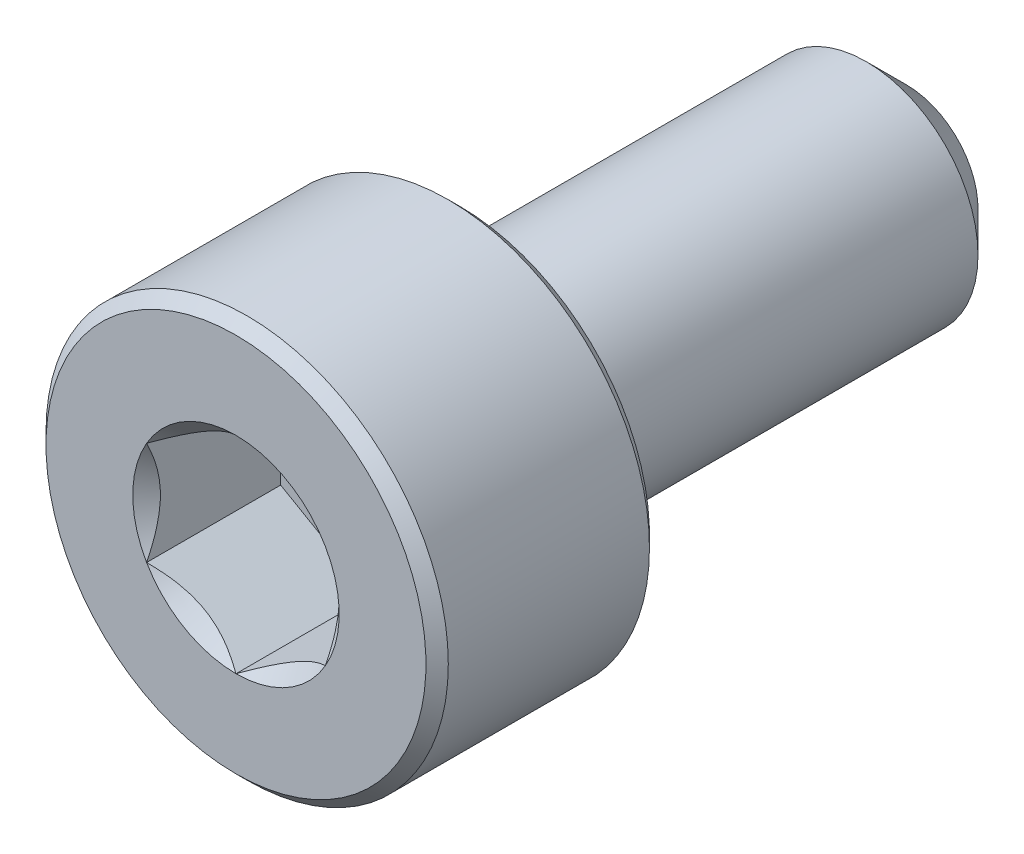
ISO-10303-21;
HEADER;
FILE_DESCRIPTION(('STEP AP214'),'2;1');
FILE_NAME('part.step','',(''),(''),'','','');
FILE_SCHEMA(('AUTOMOTIVE_DESIGN { 1 0 10303 214 1 1 1 1 }'));
ENDSEC;
DATA;
#1=APPLICATION_CONTEXT('core data for automotive mechanical design processes');
#2=APPLICATION_PROTOCOL_DEFINITION('international standard','automotive_design',2000,#1);
#3=PRODUCT_CONTEXT('',#1,'mechanical');
#4=PRODUCT('Part','Part','',(#3));
#5=PRODUCT_RELATED_PRODUCT_CATEGORY('part','',(#4));
#6=PRODUCT_DEFINITION_FORMATION('','',#4);
#7=PRODUCT_DEFINITION_CONTEXT('part definition',#1,'design');
#8=PRODUCT_DEFINITION('design','',#6,#7);
#9=PRODUCT_DEFINITION_SHAPE('','',#8);
#10=(LENGTH_UNIT() NAMED_UNIT(*) SI_UNIT(.MILLI.,.METRE.));
#11=(NAMED_UNIT(*) PLANE_ANGLE_UNIT() SI_UNIT($,.RADIAN.));
#12=(NAMED_UNIT(*) SI_UNIT($,.STERADIAN.) SOLID_ANGLE_UNIT());
#13=UNCERTAINTY_MEASURE_WITH_UNIT(LENGTH_MEASURE(1.E-05),#10,'distance_accuracy_value','');
#14=(GEOMETRIC_REPRESENTATION_CONTEXT(3) GLOBAL_UNCERTAINTY_ASSIGNED_CONTEXT((#13)) GLOBAL_UNIT_ASSIGNED_CONTEXT((#10,
#11,#12)) REPRESENTATION_CONTEXT('',''));
#15=CARTESIAN_POINT('',(0.,0.,0.));
#16=DIRECTION('',(0.,0.,1.));
#17=DIRECTION('',(1.,0.,0.));
#18=AXIS2_PLACEMENT_3D('',#15,#16,#17);
#19=CARTESIAN_POINT('',(0.,0.,3.75));
#20=DIRECTION('',(0.,0.,1.));
#21=DIRECTION('',(0.,-1.,0.));
#22=AXIS2_PLACEMENT_3D('',#19,#20,#21);
#23=PLANE('',#22);
#24=CARTESIAN_POINT('',(0.,0.,3.75));
#25=DIRECTION('',(0.,0.,1.));
#26=DIRECTION('',(1.,0.,0.));
#27=AXIS2_PLACEMENT_3D('',#24,#25,#26);
#28=CIRCLE('',#27,1.15470053837925);
#29=CARTESIAN_POINT('',(0.,-1.15470053837925,3.75));
#30=VERTEX_POINT('',#29);
#31=CARTESIAN_POINT('',(0.999999999999999,-0.577350269189624,3.75));
#32=VERTEX_POINT('',#31);
#33=EDGE_CURVE('E105',#30,#32,#28,.T.);
#34=ORIENTED_EDGE('',*,*,#33,.F.);
#35=CARTESIAN_POINT('',(-0.999999999999999,-0.577350269189626,3.75));
#36=VERTEX_POINT('',#35);
#37=EDGE_CURVE('E299',#36,#30,#28,.T.);
#38=ORIENTED_EDGE('',*,*,#37,.F.);
#39=CARTESIAN_POINT('',(-0.999999999999999,0.577350269189624,3.75));
#40=VERTEX_POINT('',#39);
#41=EDGE_CURVE('E146',#40,#36,#28,.T.);
#42=ORIENTED_EDGE('',*,*,#41,.F.);
#43=CARTESIAN_POINT('',(0.,1.15470053837925,3.75));
#44=VERTEX_POINT('',#43);
#45=EDGE_CURVE('E139',#44,#40,#28,.T.);
#46=ORIENTED_EDGE('',*,*,#45,.F.);
#47=CARTESIAN_POINT('',(0.999999999999998,0.577350269189626,3.75));
#48=VERTEX_POINT('',#47);
#49=EDGE_CURVE('E107',#48,#44,#28,.T.);
#50=ORIENTED_EDGE('',*,*,#49,.F.);
#51=EDGE_CURVE('E98',#32,#48,#28,.T.);
#52=ORIENTED_EDGE('',*,*,#51,.F.);
#53=EDGE_LOOP('',(#34,#38,#42,#46,#50,#52));
#54=FACE_BOUND('',#53,.T.);
#55=CARTESIAN_POINT('',(0.,0.,3.75));
#56=DIRECTION('',(0.,0.,-1.));
#57=DIRECTION('',(0.,1.,0.));
#58=AXIS2_PLACEMENT_3D('',#55,#56,#57);
#59=CIRCLE('',#58,2.125);
#60=CARTESIAN_POINT('',(0.,2.125,3.75));
#61=VERTEX_POINT('',#60);
#62=EDGE_CURVE('E54',#61,#61,#59,.T.);
#63=ORIENTED_EDGE('',*,*,#62,.F.);
#64=EDGE_LOOP('',(#63));
#65=FACE_BOUND('',#64,.T.);
#66=ADVANCED_FACE('F40',(#54,#65),#23,.T.);
#67=CARTESIAN_POINT('',(0.,0.,3.625));
#68=DIRECTION('',(0.,0.,-1.));
#69=DIRECTION('',(0.,1.,0.));
#70=AXIS2_PLACEMENT_3D('',#67,#68,#69);
#71=CONICAL_SURFACE('',#70,2.25,0.785398163397443);
#72=ORIENTED_EDGE('',*,*,#62,.T.);
#73=EDGE_LOOP('',(#72));
#74=FACE_BOUND('',#73,.T.);
#75=CARTESIAN_POINT('',(0.,0.,3.625));
#76=DIRECTION('',(0.,0.,-1.));
#77=DIRECTION('',(0.,1.,0.));
#78=AXIS2_PLACEMENT_3D('',#75,#76,#77);
#79=CIRCLE('',#78,2.25);
#80=CARTESIAN_POINT('',(0.,2.25,3.625));
#81=VERTEX_POINT('',#80);
#82=EDGE_CURVE('E232',#81,#81,#79,.T.);
#83=ORIENTED_EDGE('',*,*,#82,.F.);
#84=EDGE_LOOP('',(#83));
#85=FACE_BOUND('',#84,.T.);
#86=ADVANCED_FACE('F220',(#74,#85),#71,.T.);
#87=CARTESIAN_POINT('',(0.,0.,-3.75));
#88=DIRECTION('',(0.,0.,-1.));
#89=DIRECTION('',(0.,1.,0.));
#90=AXIS2_PLACEMENT_3D('',#87,#88,#89);
#91=CYLINDRICAL_SURFACE('',#90,2.25);
#92=ORIENTED_EDGE('',*,*,#82,.T.);
#93=EDGE_LOOP('',(#92));
#94=FACE_BOUND('',#93,.T.);
#95=CARTESIAN_POINT('',(0.,0.,1.375));
#96=DIRECTION('',(0.,0.,-1.));
#97=DIRECTION('',(0.,1.,0.));
#98=AXIS2_PLACEMENT_3D('',#95,#96,#97);
#99=CIRCLE('',#98,2.25);
#100=CARTESIAN_POINT('',(0.,2.25,1.375));
#101=VERTEX_POINT('',#100);
#102=EDGE_CURVE('E234',#101,#101,#99,.T.);
#103=ORIENTED_EDGE('',*,*,#102,.F.);
#104=EDGE_LOOP('',(#103));
#105=FACE_BOUND('',#104,.T.);
#106=ADVANCED_FACE('F217',(#94,#105),#91,.T.);
#107=CARTESIAN_POINT('',(0.,0.,1.25));
#108=DIRECTION('',(0.,0.,1.));
#109=DIRECTION('',(0.,-1.,0.));
#110=AXIS2_PLACEMENT_3D('',#107,#108,#109);
#111=CONICAL_SURFACE('',#110,2.125,0.785398163397447);
#112=ORIENTED_EDGE('',*,*,#102,.T.);
#113=EDGE_LOOP('',(#112));
#114=FACE_BOUND('',#113,.T.);
#115=CARTESIAN_POINT('',(0.,0.,1.25));
#116=DIRECTION('',(0.,0.,-1.));
#117=DIRECTION('',(0.,1.,0.));
#118=AXIS2_PLACEMENT_3D('',#115,#116,#117);
#119=CIRCLE('',#118,2.125);
#120=CARTESIAN_POINT('',(0.,2.125,1.25));
#121=VERTEX_POINT('',#120);
#122=EDGE_CURVE('E239',#121,#121,#119,.T.);
#123=ORIENTED_EDGE('',*,*,#122,.F.);
#124=EDGE_LOOP('',(#123));
#125=FACE_BOUND('',#124,.T.);
#126=ADVANCED_FACE('F213',(#114,#125),#111,.T.);
#127=CARTESIAN_POINT('',(0.,2.125,1.25));
#128=DIRECTION('',(0.,0.,-1.));
#129=DIRECTION('',(0.,1.,0.));
#130=AXIS2_PLACEMENT_3D('',#127,#128,#129);
#131=PLANE('',#130);
#132=ORIENTED_EDGE('',*,*,#122,.T.);
#133=EDGE_LOOP('',(#132));
#134=FACE_BOUND('',#133,.T.);
#135=CARTESIAN_POINT('',(0.,0.,1.25));
#136=DIRECTION('',(0.,0.,-1.));
#137=DIRECTION('',(0.,1.,0.));
#138=AXIS2_PLACEMENT_3D('',#135,#136,#137);
#139=CIRCLE('',#138,1.25);
#140=CARTESIAN_POINT('',(0.,1.25,1.25));
#141=VERTEX_POINT('',#140);
#142=EDGE_CURVE('E245',#141,#141,#139,.T.);
#143=ORIENTED_EDGE('',*,*,#142,.F.);
#144=EDGE_LOOP('',(#143));
#145=FACE_BOUND('',#144,.T.);
#146=ADVANCED_FACE('F209',(#134,#145),#131,.T.);
#147=CARTESIAN_POINT('',(0.,0.,-3.75));
#148=DIRECTION('',(0.,0.,-1.));
#149=DIRECTION('',(0.,1.,0.));
#150=AXIS2_PLACEMENT_3D('',#147,#148,#149);
#151=CYLINDRICAL_SURFACE('',#150,1.25);
#152=ORIENTED_EDGE('',*,*,#142,.T.);
#153=EDGE_LOOP('',(#152));
#154=FACE_BOUND('',#153,.T.);
#155=CARTESIAN_POINT('',(0.,0.,-3.29999999999999));
#156=DIRECTION('',(0.,0.,-1.));
#157=DIRECTION('',(0.,1.,0.));
#158=AXIS2_PLACEMENT_3D('',#155,#156,#157);
#159=CIRCLE('',#158,1.25);
#160=CARTESIAN_POINT('',(0.,1.25,-3.29999999999999));
#161=VERTEX_POINT('',#160);
#162=EDGE_CURVE('E249',#161,#161,#159,.T.);
#163=ORIENTED_EDGE('',*,*,#162,.F.);
#164=EDGE_LOOP('',(#163));
#165=FACE_BOUND('',#164,.T.);
#166=ADVANCED_FACE('F205',(#154,#165),#151,.T.);
#167=CARTESIAN_POINT('',(0.,0.,-3.75));
#168=DIRECTION('',(0.,0.,1.));
#169=DIRECTION('',(0.,-1.,0.));
#170=AXIS2_PLACEMENT_3D('',#167,#168,#169);
#171=CONICAL_SURFACE('',#170,0.8,0.785398163397441);
#172=ORIENTED_EDGE('',*,*,#162,.T.);
#173=EDGE_LOOP('',(#172));
#174=FACE_BOUND('',#173,.T.);
#175=CARTESIAN_POINT('',(0.,0.,-3.75));
#176=DIRECTION('',(0.,0.,-1.));
#177=DIRECTION('',(0.,1.,0.));
#178=AXIS2_PLACEMENT_3D('',#175,#176,#177);
#179=CIRCLE('',#178,0.8);
#180=CARTESIAN_POINT('',(0.,0.8,-3.75));
#181=VERTEX_POINT('',#180);
#182=EDGE_CURVE('E253',#181,#181,#179,.T.);
#183=ORIENTED_EDGE('',*,*,#182,.F.);
#184=EDGE_LOOP('',(#183));
#185=FACE_BOUND('',#184,.T.);
#186=ADVANCED_FACE('F201',(#174,#185),#171,.T.);
#187=CARTESIAN_POINT('',(0.,0.8,-3.75));
#188=DIRECTION('',(0.,0.,-1.));
#189=DIRECTION('',(0.,1.,0.));
#190=AXIS2_PLACEMENT_3D('',#187,#188,#189);
#191=PLANE('',#190);
#192=ORIENTED_EDGE('',*,*,#182,.T.);
#193=EDGE_LOOP('',(#192));
#194=FACE_BOUND('',#193,.T.);
#195=ADVANCED_FACE('F198',(#194),#191,.T.);
#196=CARTESIAN_POINT('',(0.,0.,3.75));
#197=DIRECTION('',(0.,0.,1.));
#198=DIRECTION('',(1.,0.,0.));
#199=AXIS2_PLACEMENT_3D('',#196,#197,#198);
#200=CONICAL_SURFACE('',#199,1.15470053837925,0.78539816339745);
#201=ORIENTED_EDGE('',*,*,#33,.T.);
#202=CARTESIAN_POINT('',(-0.000200000000000403,-1.15481600843309,3.75011548737261));
#203=CARTESIAN_POINT('',(0.0341825950071803,-1.13496520795025,3.73027793082573));
#204=CARTESIAN_POINT('',(0.0691401181398246,-1.11478247255942,3.71160502063889));
#205=CARTESIAN_POINT('',(0.140422802956089,-1.07362739529219,3.67741474272316));
#206=CARTESIAN_POINT('',(0.176754750528984,-1.0526511355808,3.66191640902346));
#207=CARTESIAN_POINT('',(0.250016613803311,-1.01035337909803,3.63536730714227));
#208=CARTESIAN_POINT('',(0.286927851445414,-0.989042666109239,3.62424977399693));
#209=CARTESIAN_POINT('',(0.361562729310859,-0.945952199282689,3.60711986577618));
#210=CARTESIAN_POINT('',(0.399284088108635,-0.924173762626594,3.60109469746667));
#211=CARTESIAN_POINT('',(0.464292198417933,-0.886641312640013,3.59566055496749));
#212=CARTESIAN_POINT('',(0.491494371528171,-0.870936130672274,3.59485693831673));
#213=CARTESIAN_POINT('',(0.545846040669111,-0.839556179862847,3.59620669941689));
#214=CARTESIAN_POINT('',(0.572995523754875,-0.823881418494922,3.5983607295472));
#215=CARTESIAN_POINT('',(0.654056277326959,-0.777080970599365,3.60911697212847));
#216=CARTESIAN_POINT('',(0.707564140978426,-0.746188191116429,3.62201455641536));
#217=CARTESIAN_POINT('',(0.801476065143431,-0.691968116419648,3.65314073060218));
#218=CARTESIAN_POINT('',(0.842320523671834,-0.668386557293369,3.66973779770184));
#219=CARTESIAN_POINT('',(0.922409637381943,-0.622147085933679,3.70712492468529));
#220=CARTESIAN_POINT('',(0.961659010870437,-0.599486449584573,3.7279013418174));
#221=CARTESIAN_POINT('',(1.0002,-0.577234799135786,3.75011548737261));
#222=B_SPLINE_CURVE_WITH_KNOTS('',3,(#202,#203,#204,#205,#206,#207,#208,#209,#210,#211,#212,
#213,#214,#215,#216,#217,#218,#219,#220,#221),.UNSPECIFIED.,.F.,.F.,(4,2,2,2,2,2,2,2,2,4),(0.,
0.133237676828559,0.26725222983449,0.3991370762693,0.530689603280768,0.624814864263846,
0.718960890149132,0.907306626112097,1.05710100361789,1.20641411519286),.UNSPECIFIED.);
#223=EDGE_CURVE('E12',#30,#32,#222,.T.);
#224=ORIENTED_EDGE('',*,*,#223,.F.);
#225=EDGE_LOOP('',(#201,#224));
#226=FACE_BOUND('',#225,.T.);
#227=ADVANCED_FACE('F164',(#226),#200,.F.);
#228=ORIENTED_EDGE('',*,*,#37,.T.);
#229=CARTESIAN_POINT('',(-1.0002,-0.577234799135788,3.75011548737261));
#230=CARTESIAN_POINT('',(-0.965817404992818,-0.597085599618621,3.73027793082573));
#231=CARTESIAN_POINT('',(-0.930859881860174,-0.617268335009456,3.71160502063889));
#232=CARTESIAN_POINT('',(-0.859577197043909,-0.658423412276686,3.67741474272316));
#233=CARTESIAN_POINT('',(-0.823245249471015,-0.679399671988079,3.66191640902346));
#234=CARTESIAN_POINT('',(-0.749983386196688,-0.721697428470846,3.63536730714227));
#235=CARTESIAN_POINT('',(-0.713072148554585,-0.743008141459636,3.62424977399693));
#236=CARTESIAN_POINT('',(-0.63843727068914,-0.786098608286185,3.60711986577618));
#237=CARTESIAN_POINT('',(-0.600715911891363,-0.80787704494228,3.60109469746667));
#238=CARTESIAN_POINT('',(-0.535707801582066,-0.845409494928862,3.59566055496749));
#239=CARTESIAN_POINT('',(-0.508505628471827,-0.861114676896601,3.59485693831673));
#240=CARTESIAN_POINT('',(-0.454153959330887,-0.892494627706028,3.59620669941689));
#241=CARTESIAN_POINT('',(-0.427004476245124,-0.908169389073953,3.5983607295472));
#242=CARTESIAN_POINT('',(-0.345943722673039,-0.95496983696951,3.60911697212847));
#243=CARTESIAN_POINT('',(-0.292435859021572,-0.985862616452446,3.62201455641536));
#244=CARTESIAN_POINT('',(-0.198523934856568,-1.04008269114923,3.65314073060218));
#245=CARTESIAN_POINT('',(-0.157679476328165,-1.0636642502755,3.66973779770184));
#246=CARTESIAN_POINT('',(-0.0775903626180565,-1.10990372163519,3.70712492468529));
#247=CARTESIAN_POINT('',(-0.0383409891295626,-1.1325643579843,3.7279013418174));
#248=CARTESIAN_POINT('',(0.000199999999999418,-1.15481600843309,3.75011548737261));
#249=B_SPLINE_CURVE_WITH_KNOTS('',3,(#229,#230,#231,#232,#233,#234,#235,#236,#237,#238,#239,
#240,#241,#242,#243,#244,#245,#246,#247,#248),.UNSPECIFIED.,.F.,.F.,(4,2,2,2,2,2,2,2,2,4),(0.,
0.133237676828559,0.26725222983449,0.3991370762693,0.530689603280768,0.624814864263845,
0.718960890149132,0.907306626112096,1.05710100361789,1.20641411519286),.UNSPECIFIED.);
#250=EDGE_CURVE('E141',#36,#30,#249,.T.);
#251=ORIENTED_EDGE('',*,*,#250,.F.);
#252=EDGE_LOOP('',(#228,#251));
#253=FACE_BOUND('',#252,.T.);
#254=ADVANCED_FACE('F297',(#253),#200,.F.);
#255=ORIENTED_EDGE('',*,*,#41,.T.);
#256=CARTESIAN_POINT('',(-0.999999999999999,-1.15147208646462,4.12038567751386));
#257=CARTESIAN_POINT('',(-0.999999999999999,-1.12343447988552,4.09921991987371));
#258=CARTESIAN_POINT('',(-0.999999999999999,-1.09524064850697,4.07826169217591));
#259=CARTESIAN_POINT('',(-0.999999999999999,-1.03847715644376,4.03684602223562));
#260=CARTESIAN_POINT('',(-0.999999999999999,-1.00990740382975,4.01638870612366));
#261=CARTESIAN_POINT('',(-0.999999999999999,-0.923120894333475,3.95560479495451));
#262=CARTESIAN_POINT('',(-0.999999999999999,-0.864253173759058,3.9161922289614));
#263=CARTESIAN_POINT('',(-0.999999999999999,-0.740809858258045,3.83882066420021));
#264=CARTESIAN_POINT('',(-0.999999999999999,-0.676100255137806,3.80107303911434));
#265=CARTESIAN_POINT('',(-0.999999999999999,-0.543448939049124,3.73202458755129));
#266=CARTESIAN_POINT('',(-0.999999999999999,-0.475519112027778,3.70070202784687));
#267=CARTESIAN_POINT('',(-0.999999999999999,-0.373555850333528,3.6623817788838));
#268=CARTESIAN_POINT('',(-0.999999999999999,-0.341031989670907,3.65138359164216));
#269=CARTESIAN_POINT('',(-0.999999999999999,-0.275199079052293,3.63199834214736));
#270=CARTESIAN_POINT('',(-0.999999999999999,-0.241889975173933,3.6236114597767));
#271=CARTESIAN_POINT('',(-0.999999999999999,-0.175247517042992,3.61002522071902));
#272=CARTESIAN_POINT('',(-0.999999999999999,-0.141925568218175,3.60477079076797));
#273=CARTESIAN_POINT('',(-0.999999999999999,-0.074914436232279,3.59754868657089));
#274=CARTESIAN_POINT('',(-0.999999999999999,-0.0412251978501618,3.59558151361051));
#275=CARTESIAN_POINT('',(-0.999999999999999,0.0249580992634208,3.59508319839316));
#276=CARTESIAN_POINT('',(-0.999999999999999,0.0574512826460391,3.59643026788864));
#277=CARTESIAN_POINT('',(-0.999999999999999,0.122148505701866,3.60221648449899));
#278=CARTESIAN_POINT('',(-0.999999999999999,0.154352610132926,3.60665492066154));
#279=CARTESIAN_POINT('',(-0.999999999999999,0.218799898867639,3.6184568301452));
#280=CARTESIAN_POINT('',(-0.999999999999999,0.251033743268953,3.62587054103851));
#281=CARTESIAN_POINT('',(-0.999999999999999,0.314797132354918,3.64322894249868));
#282=CARTESIAN_POINT('',(-0.999999999999999,0.346326735731004,3.65317342128883));
#283=CARTESIAN_POINT('',(-0.999999999999999,0.445594187730204,3.68822348255434));
#284=CARTESIAN_POINT('',(-0.999999999999999,0.511919139476035,3.71732085835673));
#285=CARTESIAN_POINT('',(-0.999999999999999,0.641453244657531,3.78201532968651));
#286=CARTESIAN_POINT('',(-0.999999999999999,0.704650133126343,3.81763577671524));
#287=CARTESIAN_POINT('',(-0.999999999999999,0.825428490174985,3.89112390134694));
#288=CARTESIAN_POINT('',(-0.999999999999999,0.883132947867684,3.92879194713546));
#289=CARTESIAN_POINT('',(-0.999999999999999,0.968148853704564,3.98702285294316));
#290=CARTESIAN_POINT('',(-0.999999999999999,0.996120570380284,4.00663847576286));
#291=CARTESIAN_POINT('',(-0.999999999999999,1.05168177729901,4.04638851706127));
#292=CARTESIAN_POINT('',(-0.999999999999999,1.079271369977,4.06652279219883));
#293=CARTESIAN_POINT('',(-0.999999999999999,1.10670185346329,4.08687211907297));
#294=B_SPLINE_CURVE_WITH_KNOTS('',3,(#256,#257,#258,#259,#260,#261,#262,#263,#264,#265,#266,
#267,#268,#269,#270,#271,#272,#273,#274,#275,#276,#277,#278,#279,#280,#281,#282,#283,#284,#285,
#286,#287,#288,#289,#290,#291,#292,#293),.UNSPECIFIED.,.F.,.F.,(4,2,2,2,2,2,2,2,2,2,2,2,2,2,2,2,
2,2,4),(0.,0.10538645908329,0.210799187330124,0.423233611565468,0.647793540908502,
0.871580877738608,0.974493074181419,1.07741235827201,1.17846428203204,1.27953161415762,
1.3769408673961,1.47432772585408,1.57343322804293,1.67253043972851,1.88917353996827,
2.10660791038813,2.31323734249843,2.41572589232044,2.51818641476503),.UNSPECIFIED.);
#295=EDGE_CURVE('E144',#40,#36,#294,.F.);
#296=ORIENTED_EDGE('',*,*,#295,.F.);
#297=EDGE_LOOP('',(#255,#296));
#298=FACE_BOUND('',#297,.T.);
#299=ADVANCED_FACE('F302',(#298),#200,.F.);
#300=ORIENTED_EDGE('',*,*,#45,.T.);
#301=CARTESIAN_POINT('',(0.000199999999999434,1.15481600843309,3.75011548737261));
#302=CARTESIAN_POINT('',(-0.0341825950071811,1.13496520795025,3.73027793082573));
#303=CARTESIAN_POINT('',(-0.0691401181398252,1.11478247255942,3.71160502063889));
#304=CARTESIAN_POINT('',(-0.14042280295609,1.07362739529219,3.67741474272316));
#305=CARTESIAN_POINT('',(-0.176754750528984,1.0526511355808,3.66191640902346));
#306=CARTESIAN_POINT('',(-0.250016613803311,1.01035337909803,3.63536730714227));
#307=CARTESIAN_POINT('',(-0.286927851445414,0.98904266610924,3.62424977399693));
#308=CARTESIAN_POINT('',(-0.361562729310859,0.94595219928269,3.60711986577618));
#309=CARTESIAN_POINT('',(-0.399284088108635,0.924173762626596,3.60109469746667));
#310=CARTESIAN_POINT('',(-0.464292198417933,0.886641312640014,3.5956605549675));
#311=CARTESIAN_POINT('',(-0.491494371528171,0.870936130672275,3.59485693831673));
#312=CARTESIAN_POINT('',(-0.545846040669111,0.839556179862848,3.59620669941689));
#313=CARTESIAN_POINT('',(-0.572995523754875,0.823881418494923,3.5983607295472));
#314=CARTESIAN_POINT('',(-0.654056277326959,0.777080970599366,3.60911697212847));
#315=CARTESIAN_POINT('',(-0.707564140978426,0.74618819111643,3.62201455641536));
#316=CARTESIAN_POINT('',(-0.801476065143431,0.691968116419649,3.65314073060218));
#317=CARTESIAN_POINT('',(-0.842320523671833,0.668386557293371,3.66973779770184));
#318=CARTESIAN_POINT('',(-0.922409637381943,0.622147085933681,3.70712492468529));
#319=CARTESIAN_POINT('',(-0.961659010870437,0.599486449584575,3.72790134181741));
#320=CARTESIAN_POINT('',(-1.0002,0.577234799135788,3.75011548737262));
#321=B_SPLINE_CURVE_WITH_KNOTS('',3,(#301,#302,#303,#304,#305,#306,#307,#308,#309,#310,#311,
#312,#313,#314,#315,#316,#317,#318,#319,#320),.UNSPECIFIED.,.F.,.F.,(4,2,2,2,2,2,2,2,2,4),(0.,
0.133237676828559,0.26725222983449,0.399137076269299,0.530689603280767,0.624814864263844,
0.718960890149131,0.907306626112095,1.05710100361789,1.20641411519286),.UNSPECIFIED.);
#322=EDGE_CURVE('E118',#44,#40,#321,.T.);
#323=ORIENTED_EDGE('',*,*,#322,.F.);
#324=EDGE_LOOP('',(#300,#323));
#325=FACE_BOUND('',#324,.T.);
#326=ADVANCED_FACE('F341',(#325),#200,.F.);
#327=ORIENTED_EDGE('',*,*,#49,.T.);
#328=CARTESIAN_POINT('',(1.0002,0.577234799135787,3.75011548737262));
#329=CARTESIAN_POINT('',(0.965817404992819,0.59708559961862,3.73027793082573));
#330=CARTESIAN_POINT('',(0.930859881860175,0.617268335009455,3.71160502063889));
#331=CARTESIAN_POINT('',(0.85957719704391,0.658423412276685,3.67741474272316));
#332=CARTESIAN_POINT('',(0.823245249471016,0.679399671988079,3.66191640902346));
#333=CARTESIAN_POINT('',(0.749983386196689,0.721697428470845,3.63536730714227));
#334=CARTESIAN_POINT('',(0.713072148554586,0.743008141459636,3.62424977399693));
#335=CARTESIAN_POINT('',(0.638437270689141,0.786098608286185,3.60711986577618));
#336=CARTESIAN_POINT('',(0.600715911891364,0.80787704494228,3.60109469746667));
#337=CARTESIAN_POINT('',(0.535707801582067,0.845409494928862,3.59566055496749));
#338=CARTESIAN_POINT('',(0.508505628471828,0.861114676896601,3.59485693831673));
#339=CARTESIAN_POINT('',(0.454153959330888,0.892494627706028,3.59620669941689));
#340=CARTESIAN_POINT('',(0.427004476245125,0.908169389073952,3.5983607295472));
#341=CARTESIAN_POINT('',(0.34594372267304,0.954969836969509,3.60911697212847));
#342=CARTESIAN_POINT('',(0.292435859021573,0.985862616452445,3.62201455641536));
#343=CARTESIAN_POINT('',(0.198523934856569,1.04008269114923,3.65314073060218));
#344=CARTESIAN_POINT('',(0.157679476328166,1.0636642502755,3.66973779770184));
#345=CARTESIAN_POINT('',(0.077590362618056,1.10990372163519,3.70712492468529));
#346=CARTESIAN_POINT('',(0.0383409891295618,1.1325643579843,3.7279013418174));
#347=CARTESIAN_POINT('',(-0.000200000000000499,1.15481600843309,3.75011548737262));
#348=B_SPLINE_CURVE_WITH_KNOTS('',3,(#328,#329,#330,#331,#332,#333,#334,#335,#336,#337,#338,
#339,#340,#341,#342,#343,#344,#345,#346,#347),.UNSPECIFIED.,.F.,.F.,(4,2,2,2,2,2,2,2,2,4),(0.,
0.133237676828559,0.26725222983449,0.3991370762693,0.530689603280768,0.624814864263846,
0.718960890149133,0.907306626112097,1.05710100361789,1.20641411519286),.UNSPECIFIED.);
#349=EDGE_CURVE('E110',#48,#44,#348,.T.);
#350=ORIENTED_EDGE('',*,*,#349,.F.);
#351=EDGE_LOOP('',(#327,#350));
#352=FACE_BOUND('',#351,.T.);
#353=ADVANCED_FACE('F111',(#352),#200,.F.);
#354=ORIENTED_EDGE('',*,*,#51,.T.);
#355=CARTESIAN_POINT('',(1.,-1.15147208646461,4.12038567751386));
#356=CARTESIAN_POINT('',(1.,-1.12343447988551,4.09921991987371));
#357=CARTESIAN_POINT('',(1.,-1.09524064850697,4.07826169217591));
#358=CARTESIAN_POINT('',(1.,-1.03847715644376,4.03684602223562));
#359=CARTESIAN_POINT('',(1.,-1.00990740382975,4.01638870612366));
#360=CARTESIAN_POINT('',(1.,-0.923120894333472,3.95560479495451));
#361=CARTESIAN_POINT('',(1.,-0.864253173759055,3.9161922289614));
#362=CARTESIAN_POINT('',(1.,-0.740809858258041,3.8388206642002));
#363=CARTESIAN_POINT('',(1.,-0.676100255137803,3.80107303911434));
#364=CARTESIAN_POINT('',(1.,-0.543448939049121,3.73202458755129));
#365=CARTESIAN_POINT('',(1.,-0.475519112027776,3.70070202784687));
#366=CARTESIAN_POINT('',(1.,-0.373555850333526,3.6623817788838));
#367=CARTESIAN_POINT('',(1.,-0.341031989670905,3.65138359164216));
#368=CARTESIAN_POINT('',(1.,-0.275199079052291,3.63199834214736));
#369=CARTESIAN_POINT('',(1.,-0.241889975173931,3.6236114597767));
#370=CARTESIAN_POINT('',(1.,-0.175247517042991,3.61002522071902));
#371=CARTESIAN_POINT('',(1.,-0.141925568218173,3.60477079076797));
#372=CARTESIAN_POINT('',(1.,-0.0749144362322774,3.59754868657089));
#373=CARTESIAN_POINT('',(1.,-0.0412251978501602,3.59558151361051));
#374=CARTESIAN_POINT('',(1.,0.0249580992634224,3.59508319839316));
#375=CARTESIAN_POINT('',(1.,0.0574512826460407,3.59643026788864));
#376=CARTESIAN_POINT('',(1.,0.122148505701868,3.60221648449899));
#377=CARTESIAN_POINT('',(1.,0.154352610132927,3.60665492066154));
#378=CARTESIAN_POINT('',(1.,0.218799898867641,3.61845683014521));
#379=CARTESIAN_POINT('',(1.,0.251033743268954,3.62587054103851));
#380=CARTESIAN_POINT('',(1.,0.314797132354919,3.64322894249868));
#381=CARTESIAN_POINT('',(1.,0.346326735731005,3.65317342128883));
#382=CARTESIAN_POINT('',(1.,0.445594187730205,3.68822348255434));
#383=CARTESIAN_POINT('',(1.,0.511919139476036,3.71732085835673));
#384=CARTESIAN_POINT('',(1.,0.641453244657532,3.78201532968651));
#385=CARTESIAN_POINT('',(1.,0.704650133126344,3.81763577671524));
#386=CARTESIAN_POINT('',(1.,0.825428490174986,3.89112390134694));
#387=CARTESIAN_POINT('',(1.,0.883132947867685,3.92879194713546));
#388=CARTESIAN_POINT('',(1.,0.968148853704565,3.98702285294316));
#389=CARTESIAN_POINT('',(1.,0.996120570380285,4.00663847576286));
#390=CARTESIAN_POINT('',(1.,1.05168177729901,4.04638851706127));
#391=CARTESIAN_POINT('',(1.,1.079271369977,4.06652279219883));
#392=CARTESIAN_POINT('',(1.,1.10670185346329,4.08687211907297));
#393=B_SPLINE_CURVE_WITH_KNOTS('',3,(#355,#356,#357,#358,#359,#360,#361,#362,#363,#364,#365,
#366,#367,#368,#369,#370,#371,#372,#373,#374,#375,#376,#377,#378,#379,#380,#381,#382,#383,#384,
#385,#386,#387,#388,#389,#390,#391,#392),.UNSPECIFIED.,.F.,.F.,(4,2,2,2,2,2,2,2,2,2,2,2,2,2,2,2,
2,2,4),(0.,0.105386459083291,0.210799187330124,0.423233611565468,0.647793540908501,
0.871580877738606,0.974493074181417,1.07741235827201,1.17846428203204,1.27953161415762,
1.3769408673961,1.47432772585407,1.57343322804293,1.67253043972851,1.88917353996827,
2.10660791038812,2.31323734249843,2.41572589232044,2.51818641476502),.UNSPECIFIED.);
#394=EDGE_CURVE('E60',#32,#48,#393,.T.);
#395=ORIENTED_EDGE('',*,*,#394,.F.);
#396=EDGE_LOOP('',(#354,#395));
#397=FACE_BOUND('',#396,.T.);
#398=ADVANCED_FACE('F100',(#397),#200,.F.);
#399=CARTESIAN_POINT('',(0.,2.125,2.25));
#400=DIRECTION('',(0.,0.,-1.));
#401=DIRECTION('',(0.,1.,0.));
#402=AXIS2_PLACEMENT_3D('',#399,#400,#401);
#403=PLANE('',#402);
#404=DIRECTION('',(0.866025403784438,0.5,0.));
#405=VECTOR('',#404,1.);
#406=CARTESIAN_POINT('',(0.,-1.15470053837925,2.25));
#407=LINE('',#406,#405);
#408=CARTESIAN_POINT('',(0.,-1.15470053837925,2.25));
#409=VERTEX_POINT('',#408);
#410=CARTESIAN_POINT('',(1.,-0.577350269189623,2.25));
#411=VERTEX_POINT('',#410);
#412=EDGE_CURVE('E258',#409,#411,#407,.T.);
#413=ORIENTED_EDGE('',*,*,#412,.T.);
#414=DIRECTION('',(0.,1.,0.));
#415=VECTOR('',#414,1.);
#416=CARTESIAN_POINT('',(1.,-0.577350269189623,2.25));
#417=LINE('',#416,#415);
#418=CARTESIAN_POINT('',(1.,0.577350269189625,2.25));
#419=VERTEX_POINT('',#418);
#420=EDGE_CURVE('E129',#411,#419,#417,.T.);
#421=ORIENTED_EDGE('',*,*,#420,.T.);
#422=DIRECTION('',(-0.866025403784439,0.5,0.));
#423=VECTOR('',#422,1.);
#424=CARTESIAN_POINT('',(1.,0.577350269189625,2.25));
#425=LINE('',#424,#423);
#426=CARTESIAN_POINT('',(0.,1.15470053837925,2.25));
#427=VERTEX_POINT('',#426);
#428=EDGE_CURVE('E133',#419,#427,#425,.T.);
#429=ORIENTED_EDGE('',*,*,#428,.T.);
#430=DIRECTION('',(-0.866025403784439,-0.5,0.));
#431=VECTOR('',#430,1.);
#432=CARTESIAN_POINT('',(0.,1.15470053837925,2.25));
#433=LINE('',#432,#431);
#434=CARTESIAN_POINT('',(-0.999999999999999,0.577350269189626,2.25));
#435=VERTEX_POINT('',#434);
#436=EDGE_CURVE('E263',#427,#435,#433,.T.);
#437=ORIENTED_EDGE('',*,*,#436,.T.);
#438=DIRECTION('',(0.,-1.,0.));
#439=VECTOR('',#438,1.);
#440=CARTESIAN_POINT('',(-0.999999999999999,0.577350269189625,2.25));
#441=LINE('',#440,#439);
#442=CARTESIAN_POINT('',(-0.999999999999999,-0.577350269189626,2.25));
#443=VERTEX_POINT('',#442);
#444=EDGE_CURVE('E268',#435,#443,#441,.T.);
#445=ORIENTED_EDGE('',*,*,#444,.T.);
#446=DIRECTION('',(0.866025403784439,-0.5,0.));
#447=VECTOR('',#446,1.);
#448=CARTESIAN_POINT('',(-0.999999999999999,-0.577350269189626,2.25));
#449=LINE('',#448,#447);
#450=EDGE_CURVE('E271',#443,#409,#449,.T.);
#451=ORIENTED_EDGE('',*,*,#450,.T.);
#452=EDGE_LOOP('',(#413,#421,#429,#437,#445,#451));
#453=FACE_BOUND('',#452,.T.);
#454=ADVANCED_FACE('F163',(#453),#403,.F.);
#455=CARTESIAN_POINT('',(0.,-1.15470053837925,-1.80505046330389));
#456=DIRECTION('',(0.5,-0.866025403784438,0.));
#457=DIRECTION('',(0.866025403784438,0.5,0.));
#458=AXIS2_PLACEMENT_3D('',#455,#456,#457);
#459=PLANE('',#458);
#460=DIRECTION('',(0.,0.,1.));
#461=VECTOR('',#460,1.);
#462=CARTESIAN_POINT('',(0.,-1.15470053837925,-1.80505046330389));
#463=LINE('',#462,#461);
#464=EDGE_CURVE('E272',#409,#30,#463,.T.);
#465=ORIENTED_EDGE('',*,*,#464,.T.);
#466=ORIENTED_EDGE('',*,*,#223,.T.);
#467=DIRECTION('',(0.,0.,1.));
#468=VECTOR('',#467,1.);
#469=CARTESIAN_POINT('',(1.,-0.577350269189623,-1.80505046330389));
#470=LINE('',#469,#468);
#471=EDGE_CURVE('E127',#411,#32,#470,.T.);
#472=ORIENTED_EDGE('',*,*,#471,.F.);
#473=ORIENTED_EDGE('',*,*,#412,.F.);
#474=EDGE_LOOP('',(#465,#466,#472,#473));
#475=FACE_BOUND('',#474,.T.);
#476=ADVANCED_FACE('F165',(#475),#459,.F.);
#477=CARTESIAN_POINT('',(-0.999999999999999,-0.577350269189626,-1.80505046330389));
#478=DIRECTION('',(-0.5,-0.866025403784439,0.));
#479=DIRECTION('',(0.866025403784439,-0.5,0.));
#480=AXIS2_PLACEMENT_3D('',#477,#478,#479);
#481=PLANE('',#480);
#482=DIRECTION('',(0.,0.,1.));
#483=VECTOR('',#482,1.);
#484=CARTESIAN_POINT('',(-0.999999999999999,-0.577350269189626,-1.80505046330389));
#485=LINE('',#484,#483);
#486=EDGE_CURVE('E68',#443,#36,#485,.T.);
#487=ORIENTED_EDGE('',*,*,#486,.T.);
#488=ORIENTED_EDGE('',*,*,#250,.T.);
#489=ORIENTED_EDGE('',*,*,#464,.F.);
#490=ORIENTED_EDGE('',*,*,#450,.F.);
#491=EDGE_LOOP('',(#487,#488,#489,#490));
#492=FACE_BOUND('',#491,.T.);
#493=ADVANCED_FACE('F159',(#492),#481,.F.);
#494=CARTESIAN_POINT('',(-0.999999999999999,0.577350269189625,-1.80505046330389));
#495=DIRECTION('',(-1.,0.,0.));
#496=DIRECTION('',(0.,-1.,0.));
#497=AXIS2_PLACEMENT_3D('',#494,#495,#496);
#498=PLANE('',#497);
#499=DIRECTION('',(0.,0.,1.));
#500=VECTOR('',#499,1.);
#501=CARTESIAN_POINT('',(-0.999999999999999,0.577350269189625,-1.80505046330389));
#502=LINE('',#501,#500);
#503=EDGE_CURVE('E264',#435,#40,#502,.T.);
#504=ORIENTED_EDGE('',*,*,#503,.T.);
#505=ORIENTED_EDGE('',*,*,#295,.T.);
#506=ORIENTED_EDGE('',*,*,#486,.F.);
#507=ORIENTED_EDGE('',*,*,#444,.F.);
#508=EDGE_LOOP('',(#504,#505,#506,#507));
#509=FACE_BOUND('',#508,.T.);
#510=ADVANCED_FACE('F313',(#509),#498,.F.);
#511=CARTESIAN_POINT('',(0.,1.15470053837925,-1.80505046330389));
#512=DIRECTION('',(-0.5,0.866025403784439,0.));
#513=DIRECTION('',(-0.866025403784439,-0.5,0.));
#514=AXIS2_PLACEMENT_3D('',#511,#512,#513);
#515=PLANE('',#514);
#516=DIRECTION('',(0.,0.,1.));
#517=VECTOR('',#516,1.);
#518=CARTESIAN_POINT('',(0.,1.15470053837925,-1.80505046330389));
#519=LINE('',#518,#517);
#520=EDGE_CURVE('E260',#427,#44,#519,.T.);
#521=ORIENTED_EDGE('',*,*,#520,.T.);
#522=ORIENTED_EDGE('',*,*,#322,.T.);
#523=ORIENTED_EDGE('',*,*,#503,.F.);
#524=ORIENTED_EDGE('',*,*,#436,.F.);
#525=EDGE_LOOP('',(#521,#522,#523,#524));
#526=FACE_BOUND('',#525,.T.);
#527=ADVANCED_FACE('F190',(#526),#515,.F.);
#528=CARTESIAN_POINT('',(1.,0.577350269189625,-1.80505046330389));
#529=DIRECTION('',(0.5,0.866025403784439,0.));
#530=DIRECTION('',(-0.866025403784439,0.5,0.));
#531=AXIS2_PLACEMENT_3D('',#528,#529,#530);
#532=PLANE('',#531);
#533=DIRECTION('',(0.,0.,1.));
#534=VECTOR('',#533,1.);
#535=CARTESIAN_POINT('',(1.,0.577350269189625,-1.80505046330389));
#536=LINE('',#535,#534);
#537=EDGE_CURVE('E124',#419,#48,#536,.T.);
#538=ORIENTED_EDGE('',*,*,#537,.T.);
#539=ORIENTED_EDGE('',*,*,#349,.T.);
#540=ORIENTED_EDGE('',*,*,#520,.F.);
#541=ORIENTED_EDGE('',*,*,#428,.F.);
#542=EDGE_LOOP('',(#538,#539,#540,#541));
#543=FACE_BOUND('',#542,.T.);
#544=ADVANCED_FACE('F131',(#543),#532,.F.);
#545=CARTESIAN_POINT('',(1.,-0.577350269189623,-1.80505046330389));
#546=DIRECTION('',(1.,0.,0.));
#547=DIRECTION('',(0.,0.,-1.));
#548=AXIS2_PLACEMENT_3D('',#545,#546,#547);
#549=PLANE('',#548);
#550=ORIENTED_EDGE('',*,*,#471,.T.);
#551=ORIENTED_EDGE('',*,*,#394,.T.);
#552=ORIENTED_EDGE('',*,*,#537,.F.);
#553=ORIENTED_EDGE('',*,*,#420,.F.);
#554=EDGE_LOOP('',(#550,#551,#552,#553));
#555=FACE_BOUND('',#554,.T.);
#556=ADVANCED_FACE('F123',(#555),#549,.F.);
#557=CLOSED_SHELL('',(#66,#86,#106,#126,#146,#166,#186,#195,#227,#254,#299,#326,#353,#398,#454,
#476,#493,#510,#527,#544,#556));
#558=MANIFOLD_SOLID_BREP('B2',#557);
#559=ADVANCED_BREP_SHAPE_REPRESENTATION('',(#18,#558),#14);
#560=SHAPE_DEFINITION_REPRESENTATION(#9,#559);
ENDSEC;
END-ISO-10303-21;
